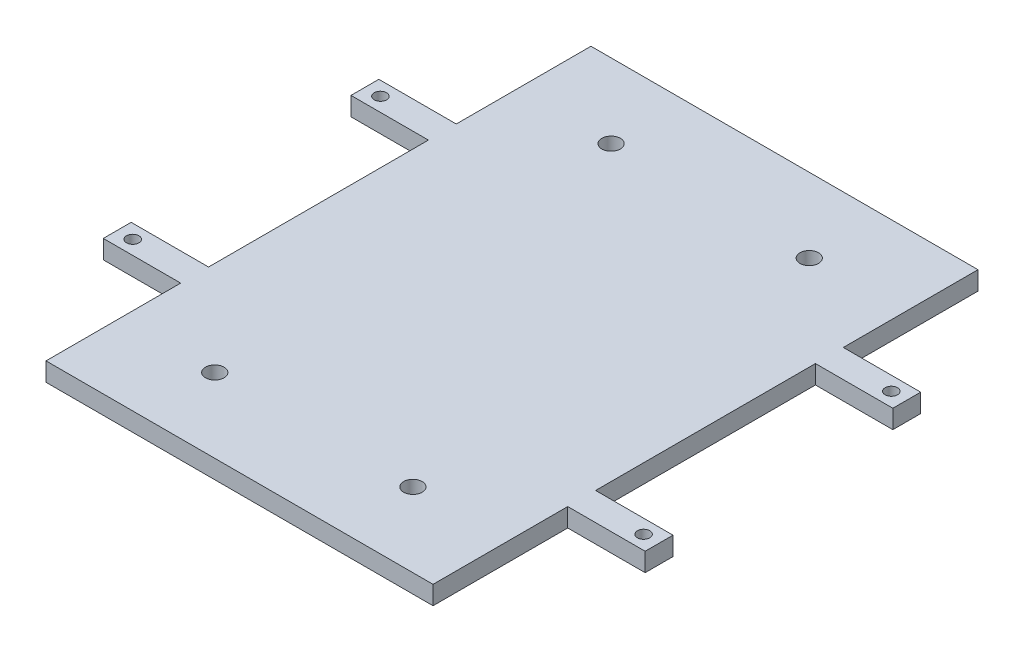
ISO-10303-21;
HEADER;
FILE_DESCRIPTION(('STEP AP214'),'2;1');
FILE_NAME('part.step','',(''),(''),'','','');
FILE_SCHEMA(('AUTOMOTIVE_DESIGN { 1 0 10303 214 1 1 1 1 }'));
ENDSEC;
DATA;
#1=APPLICATION_CONTEXT('core data for automotive mechanical design processes');
#2=APPLICATION_PROTOCOL_DEFINITION('international standard','automotive_design',2000,#1);
#3=PRODUCT_CONTEXT('',#1,'mechanical');
#4=PRODUCT('Part','Part','',(#3));
#5=PRODUCT_RELATED_PRODUCT_CATEGORY('part','',(#4));
#6=PRODUCT_DEFINITION_FORMATION('','',#4);
#7=PRODUCT_DEFINITION_CONTEXT('part definition',#1,'design');
#8=PRODUCT_DEFINITION('design','',#6,#7);
#9=PRODUCT_DEFINITION_SHAPE('','',#8);
#10=(LENGTH_UNIT() NAMED_UNIT(*) SI_UNIT(.MILLI.,.METRE.));
#11=(NAMED_UNIT(*) PLANE_ANGLE_UNIT() SI_UNIT($,.RADIAN.));
#12=(NAMED_UNIT(*) SI_UNIT($,.STERADIAN.) SOLID_ANGLE_UNIT());
#13=UNCERTAINTY_MEASURE_WITH_UNIT(LENGTH_MEASURE(1.E-05),#10,'distance_accuracy_value','');
#14=(GEOMETRIC_REPRESENTATION_CONTEXT(3) GLOBAL_UNCERTAINTY_ASSIGNED_CONTEXT((#13)) GLOBAL_UNIT_ASSIGNED_CONTEXT((#10,
#11,#12)) REPRESENTATION_CONTEXT('',''));
#15=CARTESIAN_POINT('',(0.,0.,0.));
#16=DIRECTION('',(0.,0.,1.));
#17=DIRECTION('',(1.,0.,0.));
#18=AXIS2_PLACEMENT_3D('',#15,#16,#17);
#19=CARTESIAN_POINT('',(31.25,3.,-44.));
#20=DIRECTION('',(-1.,0.,0.));
#21=DIRECTION('',(0.,0.,1.));
#22=AXIS2_PLACEMENT_3D('',#19,#20,#21);
#23=PLANE('',#22);
#24=DIRECTION('',(0.,0.,-1.));
#25=VECTOR('',#24,1.);
#26=CARTESIAN_POINT('',(31.25,0.,-44.));
#27=LINE('',#26,#25);
#28=CARTESIAN_POINT('',(31.25,0.,-22.25));
#29=VERTEX_POINT('',#28);
#30=CARTESIAN_POINT('',(31.25,0.,-44.));
#31=VERTEX_POINT('',#30);
#32=EDGE_CURVE('E205',#29,#31,#27,.T.);
#33=ORIENTED_EDGE('',*,*,#32,.T.);
#34=DIRECTION('',(0.,-1.,0.));
#35=VECTOR('',#34,1.);
#36=CARTESIAN_POINT('',(31.25,3.,-44.));
#37=LINE('',#36,#35);
#38=CARTESIAN_POINT('',(31.25,3.,-44.));
#39=VERTEX_POINT('',#38);
#40=EDGE_CURVE('E11',#39,#31,#37,.T.);
#41=ORIENTED_EDGE('',*,*,#40,.F.);
#42=DIRECTION('',(0.,0.,-1.));
#43=VECTOR('',#42,1.);
#44=CARTESIAN_POINT('',(31.25,3.,-44.));
#45=LINE('',#44,#43);
#46=CARTESIAN_POINT('',(31.25,3.,-22.25));
#47=VERTEX_POINT('',#46);
#48=EDGE_CURVE('E244',#47,#39,#45,.T.);
#49=ORIENTED_EDGE('',*,*,#48,.F.);
#50=DIRECTION('',(0.,-1.,0.));
#51=VECTOR('',#50,1.);
#52=CARTESIAN_POINT('',(31.25,3.,-22.25));
#53=LINE('',#52,#51);
#54=EDGE_CURVE('E201',#47,#29,#53,.T.);
#55=ORIENTED_EDGE('',*,*,#54,.T.);
#56=EDGE_LOOP('',(#33,#41,#49,#55));
#57=FACE_BOUND('',#56,.T.);
#58=ADVANCED_FACE('F35',(#57),#23,.F.);
#59=CARTESIAN_POINT('',(31.25,3.,-44.));
#60=DIRECTION('',(0.,0.,1.));
#61=DIRECTION('',(1.,0.,0.));
#62=AXIS2_PLACEMENT_3D('',#59,#60,#61);
#63=PLANE('',#62);
#64=DIRECTION('',(-1.,0.,0.));
#65=VECTOR('',#64,1.);
#66=CARTESIAN_POINT('',(31.25,0.,-44.));
#67=LINE('',#66,#65);
#68=CARTESIAN_POINT('',(-31.25,0.,-44.));
#69=VERTEX_POINT('',#68);
#70=EDGE_CURVE('E208',#31,#69,#67,.T.);
#71=ORIENTED_EDGE('',*,*,#70,.T.);
#72=DIRECTION('',(0.,-1.,0.));
#73=VECTOR('',#72,1.);
#74=CARTESIAN_POINT('',(-31.25,3.,-44.));
#75=LINE('',#74,#73);
#76=CARTESIAN_POINT('',(-31.25,3.,-44.));
#77=VERTEX_POINT('',#76);
#78=EDGE_CURVE('E44',#77,#69,#75,.T.);
#79=ORIENTED_EDGE('',*,*,#78,.F.);
#80=DIRECTION('',(-1.,0.,0.));
#81=VECTOR('',#80,1.);
#82=CARTESIAN_POINT('',(31.25,3.,-44.));
#83=LINE('',#82,#81);
#84=EDGE_CURVE('E132',#39,#77,#83,.T.);
#85=ORIENTED_EDGE('',*,*,#84,.F.);
#86=ORIENTED_EDGE('',*,*,#40,.T.);
#87=EDGE_LOOP('',(#71,#79,#85,#86));
#88=FACE_BOUND('',#87,.T.);
#89=ADVANCED_FACE('F388',(#88),#63,.F.);
#90=CARTESIAN_POINT('',(-31.25,3.,-44.));
#91=DIRECTION('',(1.,0.,0.));
#92=DIRECTION('',(0.,0.,-1.));
#93=AXIS2_PLACEMENT_3D('',#90,#91,#92);
#94=PLANE('',#93);
#95=DIRECTION('',(0.,0.,1.));
#96=VECTOR('',#95,1.);
#97=CARTESIAN_POINT('',(-31.25,0.,-44.));
#98=LINE('',#97,#96);
#99=CARTESIAN_POINT('',(-31.25,0.,-22.25));
#100=VERTEX_POINT('',#99);
#101=EDGE_CURVE('E211',#69,#100,#98,.T.);
#102=ORIENTED_EDGE('',*,*,#101,.T.);
#103=DIRECTION('',(0.,-1.,0.));
#104=VECTOR('',#103,1.);
#105=CARTESIAN_POINT('',(-31.25,3.,-22.25));
#106=LINE('',#105,#104);
#107=CARTESIAN_POINT('',(-31.25,3.,-22.25));
#108=VERTEX_POINT('',#107);
#109=EDGE_CURVE('E287',#108,#100,#106,.T.);
#110=ORIENTED_EDGE('',*,*,#109,.F.);
#111=DIRECTION('',(0.,0.,1.));
#112=VECTOR('',#111,1.);
#113=CARTESIAN_POINT('',(-31.25,3.,-44.));
#114=LINE('',#113,#112);
#115=EDGE_CURVE('E332',#77,#108,#114,.T.);
#116=ORIENTED_EDGE('',*,*,#115,.F.);
#117=ORIENTED_EDGE('',*,*,#78,.T.);
#118=EDGE_LOOP('',(#102,#110,#116,#117));
#119=FACE_BOUND('',#118,.T.);
#120=ADVANCED_FACE('F392',(#119),#94,.F.);
#121=CARTESIAN_POINT('',(-43.75,3.,-22.25));
#122=DIRECTION('',(0.,0.,1.));
#123=DIRECTION('',(1.,0.,0.));
#124=AXIS2_PLACEMENT_3D('',#121,#122,#123);
#125=PLANE('',#124);
#126=DIRECTION('',(-1.,0.,0.));
#127=VECTOR('',#126,1.);
#128=CARTESIAN_POINT('',(-43.75,0.,-22.25));
#129=LINE('',#128,#127);
#130=CARTESIAN_POINT('',(-43.75,0.,-22.25));
#131=VERTEX_POINT('',#130);
#132=EDGE_CURVE('E213',#100,#131,#129,.T.);
#133=ORIENTED_EDGE('',*,*,#132,.T.);
#134=DIRECTION('',(0.,-1.,0.));
#135=VECTOR('',#134,1.);
#136=CARTESIAN_POINT('',(-43.75,3.,-22.25));
#137=LINE('',#136,#135);
#138=CARTESIAN_POINT('',(-43.75,3.,-22.25));
#139=VERTEX_POINT('',#138);
#140=EDGE_CURVE('E284',#139,#131,#137,.T.);
#141=ORIENTED_EDGE('',*,*,#140,.F.);
#142=DIRECTION('',(-1.,0.,0.));
#143=VECTOR('',#142,1.);
#144=CARTESIAN_POINT('',(-43.75,3.,-22.25));
#145=LINE('',#144,#143);
#146=EDGE_CURVE('E334',#108,#139,#145,.T.);
#147=ORIENTED_EDGE('',*,*,#146,.F.);
#148=ORIENTED_EDGE('',*,*,#109,.T.);
#149=EDGE_LOOP('',(#133,#141,#147,#148));
#150=FACE_BOUND('',#149,.T.);
#151=ADVANCED_FACE('F396',(#150),#125,.F.);
#152=CARTESIAN_POINT('',(-43.75,3.,-22.25));
#153=DIRECTION('',(1.,0.,0.));
#154=DIRECTION('',(0.,0.,-1.));
#155=AXIS2_PLACEMENT_3D('',#152,#153,#154);
#156=PLANE('',#155);
#157=DIRECTION('',(0.,0.,1.));
#158=VECTOR('',#157,1.);
#159=CARTESIAN_POINT('',(-43.75,0.,-22.25));
#160=LINE('',#159,#158);
#161=CARTESIAN_POINT('',(-43.75,0.,-17.75));
#162=VERTEX_POINT('',#161);
#163=EDGE_CURVE('E215',#131,#162,#160,.T.);
#164=ORIENTED_EDGE('',*,*,#163,.T.);
#165=DIRECTION('',(0.,-1.,0.));
#166=VECTOR('',#165,1.);
#167=CARTESIAN_POINT('',(-43.75,3.,-17.75));
#168=LINE('',#167,#166);
#169=CARTESIAN_POINT('',(-43.75,3.,-17.75));
#170=VERTEX_POINT('',#169);
#171=EDGE_CURVE('E281',#170,#162,#168,.T.);
#172=ORIENTED_EDGE('',*,*,#171,.F.);
#173=DIRECTION('',(0.,0.,1.));
#174=VECTOR('',#173,1.);
#175=CARTESIAN_POINT('',(-43.75,3.,-22.25));
#176=LINE('',#175,#174);
#177=EDGE_CURVE('E336',#139,#170,#176,.T.);
#178=ORIENTED_EDGE('',*,*,#177,.F.);
#179=ORIENTED_EDGE('',*,*,#140,.T.);
#180=EDGE_LOOP('',(#164,#172,#178,#179));
#181=FACE_BOUND('',#180,.T.);
#182=ADVANCED_FACE('F402',(#181),#156,.F.);
#183=CARTESIAN_POINT('',(-43.75,3.,-17.75));
#184=DIRECTION('',(0.,0.,-1.));
#185=DIRECTION('',(-1.,0.,0.));
#186=AXIS2_PLACEMENT_3D('',#183,#184,#185);
#187=PLANE('',#186);
#188=DIRECTION('',(1.,0.,0.));
#189=VECTOR('',#188,1.);
#190=CARTESIAN_POINT('',(-43.75,0.,-17.75));
#191=LINE('',#190,#189);
#192=CARTESIAN_POINT('',(-31.25,0.,-17.75));
#193=VERTEX_POINT('',#192);
#194=EDGE_CURVE('E217',#162,#193,#191,.T.);
#195=ORIENTED_EDGE('',*,*,#194,.T.);
#196=DIRECTION('',(0.,-1.,0.));
#197=VECTOR('',#196,1.);
#198=CARTESIAN_POINT('',(-31.25,3.,-17.75));
#199=LINE('',#198,#197);
#200=CARTESIAN_POINT('',(-31.25,3.,-17.75));
#201=VERTEX_POINT('',#200);
#202=EDGE_CURVE('E278',#201,#193,#199,.T.);
#203=ORIENTED_EDGE('',*,*,#202,.F.);
#204=DIRECTION('',(1.,0.,0.));
#205=VECTOR('',#204,1.);
#206=CARTESIAN_POINT('',(-43.75,3.,-17.75));
#207=LINE('',#206,#205);
#208=EDGE_CURVE('E338',#170,#201,#207,.T.);
#209=ORIENTED_EDGE('',*,*,#208,.F.);
#210=ORIENTED_EDGE('',*,*,#171,.T.);
#211=EDGE_LOOP('',(#195,#203,#209,#210));
#212=FACE_BOUND('',#211,.T.);
#213=ADVANCED_FACE('F406',(#212),#187,.F.);
#214=CARTESIAN_POINT('',(-31.25,3.,17.75));
#215=DIRECTION('',(1.,0.,0.));
#216=DIRECTION('',(0.,0.,-1.));
#217=AXIS2_PLACEMENT_3D('',#214,#215,#216);
#218=PLANE('',#217);
#219=DIRECTION('',(0.,0.,1.));
#220=VECTOR('',#219,1.);
#221=CARTESIAN_POINT('',(-31.25,0.,17.75));
#222=LINE('',#221,#220);
#223=CARTESIAN_POINT('',(-31.25,0.,17.75));
#224=VERTEX_POINT('',#223);
#225=EDGE_CURVE('E219',#193,#224,#222,.T.);
#226=ORIENTED_EDGE('',*,*,#225,.T.);
#227=DIRECTION('',(0.,-1.,0.));
#228=VECTOR('',#227,1.);
#229=CARTESIAN_POINT('',(-31.25,3.,17.75));
#230=LINE('',#229,#228);
#231=CARTESIAN_POINT('',(-31.25,3.,17.75));
#232=VERTEX_POINT('',#231);
#233=EDGE_CURVE('E275',#232,#224,#230,.T.);
#234=ORIENTED_EDGE('',*,*,#233,.F.);
#235=DIRECTION('',(0.,0.,1.));
#236=VECTOR('',#235,1.);
#237=CARTESIAN_POINT('',(-31.25,3.,17.75));
#238=LINE('',#237,#236);
#239=EDGE_CURVE('E340',#201,#232,#238,.T.);
#240=ORIENTED_EDGE('',*,*,#239,.F.);
#241=ORIENTED_EDGE('',*,*,#202,.T.);
#242=EDGE_LOOP('',(#226,#234,#240,#241));
#243=FACE_BOUND('',#242,.T.);
#244=ADVANCED_FACE('F410',(#243),#218,.F.);
#245=CARTESIAN_POINT('',(-43.75,3.,17.75));
#246=DIRECTION('',(0.,0.,1.));
#247=DIRECTION('',(1.,0.,0.));
#248=AXIS2_PLACEMENT_3D('',#245,#246,#247);
#249=PLANE('',#248);
#250=DIRECTION('',(-1.,0.,0.));
#251=VECTOR('',#250,1.);
#252=CARTESIAN_POINT('',(-43.75,0.,17.75));
#253=LINE('',#252,#251);
#254=CARTESIAN_POINT('',(-43.75,0.,17.75));
#255=VERTEX_POINT('',#254);
#256=EDGE_CURVE('E221',#224,#255,#253,.T.);
#257=ORIENTED_EDGE('',*,*,#256,.T.);
#258=DIRECTION('',(0.,-1.,0.));
#259=VECTOR('',#258,1.);
#260=CARTESIAN_POINT('',(-43.75,3.,17.75));
#261=LINE('',#260,#259);
#262=CARTESIAN_POINT('',(-43.75,3.,17.75));
#263=VERTEX_POINT('',#262);
#264=EDGE_CURVE('E272',#263,#255,#261,.T.);
#265=ORIENTED_EDGE('',*,*,#264,.F.);
#266=DIRECTION('',(-1.,0.,0.));
#267=VECTOR('',#266,1.);
#268=CARTESIAN_POINT('',(-43.75,3.,17.75));
#269=LINE('',#268,#267);
#270=EDGE_CURVE('E342',#232,#263,#269,.T.);
#271=ORIENTED_EDGE('',*,*,#270,.F.);
#272=ORIENTED_EDGE('',*,*,#233,.T.);
#273=EDGE_LOOP('',(#257,#265,#271,#272));
#274=FACE_BOUND('',#273,.T.);
#275=ADVANCED_FACE('F414',(#274),#249,.F.);
#276=CARTESIAN_POINT('',(-43.75,3.,22.25));
#277=DIRECTION('',(1.,0.,0.));
#278=DIRECTION('',(0.,0.,-1.));
#279=AXIS2_PLACEMENT_3D('',#276,#277,#278);
#280=PLANE('',#279);
#281=DIRECTION('',(0.,0.,1.));
#282=VECTOR('',#281,1.);
#283=CARTESIAN_POINT('',(-43.75,0.,22.25));
#284=LINE('',#283,#282);
#285=CARTESIAN_POINT('',(-43.75,0.,22.25));
#286=VERTEX_POINT('',#285);
#287=EDGE_CURVE('E223',#255,#286,#284,.T.);
#288=ORIENTED_EDGE('',*,*,#287,.T.);
#289=DIRECTION('',(0.,-1.,0.));
#290=VECTOR('',#289,1.);
#291=CARTESIAN_POINT('',(-43.75,3.,22.25));
#292=LINE('',#291,#290);
#293=CARTESIAN_POINT('',(-43.75,3.,22.25));
#294=VERTEX_POINT('',#293);
#295=EDGE_CURVE('E269',#294,#286,#292,.T.);
#296=ORIENTED_EDGE('',*,*,#295,.F.);
#297=DIRECTION('',(0.,0.,1.));
#298=VECTOR('',#297,1.);
#299=CARTESIAN_POINT('',(-43.75,3.,22.25));
#300=LINE('',#299,#298);
#301=EDGE_CURVE('E344',#263,#294,#300,.T.);
#302=ORIENTED_EDGE('',*,*,#301,.F.);
#303=ORIENTED_EDGE('',*,*,#264,.T.);
#304=EDGE_LOOP('',(#288,#296,#302,#303));
#305=FACE_BOUND('',#304,.T.);
#306=ADVANCED_FACE('F418',(#305),#280,.F.);
#307=CARTESIAN_POINT('',(-43.75,3.,22.25));
#308=DIRECTION('',(0.,0.,-1.));
#309=DIRECTION('',(-1.,0.,0.));
#310=AXIS2_PLACEMENT_3D('',#307,#308,#309);
#311=PLANE('',#310);
#312=DIRECTION('',(1.,0.,0.));
#313=VECTOR('',#312,1.);
#314=CARTESIAN_POINT('',(-43.75,0.,22.25));
#315=LINE('',#314,#313);
#316=CARTESIAN_POINT('',(-31.25,0.,22.25));
#317=VERTEX_POINT('',#316);
#318=EDGE_CURVE('E225',#286,#317,#315,.T.);
#319=ORIENTED_EDGE('',*,*,#318,.T.);
#320=DIRECTION('',(0.,-1.,0.));
#321=VECTOR('',#320,1.);
#322=CARTESIAN_POINT('',(-31.25,3.,22.25));
#323=LINE('',#322,#321);
#324=CARTESIAN_POINT('',(-31.25,3.,22.25));
#325=VERTEX_POINT('',#324);
#326=EDGE_CURVE('E266',#325,#317,#323,.T.);
#327=ORIENTED_EDGE('',*,*,#326,.F.);
#328=DIRECTION('',(1.,0.,0.));
#329=VECTOR('',#328,1.);
#330=CARTESIAN_POINT('',(-43.75,3.,22.25));
#331=LINE('',#330,#329);
#332=EDGE_CURVE('E346',#294,#325,#331,.T.);
#333=ORIENTED_EDGE('',*,*,#332,.F.);
#334=ORIENTED_EDGE('',*,*,#295,.T.);
#335=EDGE_LOOP('',(#319,#327,#333,#334));
#336=FACE_BOUND('',#335,.T.);
#337=ADVANCED_FACE('F422',(#336),#311,.F.);
#338=CARTESIAN_POINT('',(-31.25,3.,44.));
#339=DIRECTION('',(1.,0.,0.));
#340=DIRECTION('',(0.,0.,-1.));
#341=AXIS2_PLACEMENT_3D('',#338,#339,#340);
#342=PLANE('',#341);
#343=DIRECTION('',(0.,0.,1.));
#344=VECTOR('',#343,1.);
#345=CARTESIAN_POINT('',(-31.25,0.,44.));
#346=LINE('',#345,#344);
#347=CARTESIAN_POINT('',(-31.25,0.,44.));
#348=VERTEX_POINT('',#347);
#349=EDGE_CURVE('E227',#317,#348,#346,.T.);
#350=ORIENTED_EDGE('',*,*,#349,.T.);
#351=DIRECTION('',(0.,-1.,0.));
#352=VECTOR('',#351,1.);
#353=CARTESIAN_POINT('',(-31.25,3.,44.));
#354=LINE('',#353,#352);
#355=CARTESIAN_POINT('',(-31.25,3.,44.));
#356=VERTEX_POINT('',#355);
#357=EDGE_CURVE('E263',#356,#348,#354,.T.);
#358=ORIENTED_EDGE('',*,*,#357,.F.);
#359=DIRECTION('',(0.,0.,1.));
#360=VECTOR('',#359,1.);
#361=CARTESIAN_POINT('',(-31.25,3.,44.));
#362=LINE('',#361,#360);
#363=EDGE_CURVE('E348',#325,#356,#362,.T.);
#364=ORIENTED_EDGE('',*,*,#363,.F.);
#365=ORIENTED_EDGE('',*,*,#326,.T.);
#366=EDGE_LOOP('',(#350,#358,#364,#365));
#367=FACE_BOUND('',#366,.T.);
#368=ADVANCED_FACE('F426',(#367),#342,.F.);
#369=CARTESIAN_POINT('',(31.25,3.,44.));
#370=DIRECTION('',(0.,0.,-1.));
#371=DIRECTION('',(-1.,0.,0.));
#372=AXIS2_PLACEMENT_3D('',#369,#370,#371);
#373=PLANE('',#372);
#374=DIRECTION('',(1.,0.,0.));
#375=VECTOR('',#374,1.);
#376=CARTESIAN_POINT('',(31.25,0.,44.));
#377=LINE('',#376,#375);
#378=CARTESIAN_POINT('',(31.25,0.,44.));
#379=VERTEX_POINT('',#378);
#380=EDGE_CURVE('E229',#348,#379,#377,.T.);
#381=ORIENTED_EDGE('',*,*,#380,.T.);
#382=DIRECTION('',(0.,-1.,0.));
#383=VECTOR('',#382,1.);
#384=CARTESIAN_POINT('',(31.25,3.,44.));
#385=LINE('',#384,#383);
#386=CARTESIAN_POINT('',(31.25,3.,44.));
#387=VERTEX_POINT('',#386);
#388=EDGE_CURVE('E260',#387,#379,#385,.T.);
#389=ORIENTED_EDGE('',*,*,#388,.F.);
#390=DIRECTION('',(1.,0.,0.));
#391=VECTOR('',#390,1.);
#392=CARTESIAN_POINT('',(31.25,3.,44.));
#393=LINE('',#392,#391);
#394=EDGE_CURVE('E350',#356,#387,#393,.T.);
#395=ORIENTED_EDGE('',*,*,#394,.F.);
#396=ORIENTED_EDGE('',*,*,#357,.T.);
#397=EDGE_LOOP('',(#381,#389,#395,#396));
#398=FACE_BOUND('',#397,.T.);
#399=ADVANCED_FACE('F430',(#398),#373,.F.);
#400=CARTESIAN_POINT('',(31.25,3.,44.));
#401=DIRECTION('',(-1.,0.,0.));
#402=DIRECTION('',(0.,0.,1.));
#403=AXIS2_PLACEMENT_3D('',#400,#401,#402);
#404=PLANE('',#403);
#405=DIRECTION('',(0.,0.,-1.));
#406=VECTOR('',#405,1.);
#407=CARTESIAN_POINT('',(31.25,0.,44.));
#408=LINE('',#407,#406);
#409=CARTESIAN_POINT('',(31.25,0.,22.25));
#410=VERTEX_POINT('',#409);
#411=EDGE_CURVE('E231',#379,#410,#408,.T.);
#412=ORIENTED_EDGE('',*,*,#411,.T.);
#413=DIRECTION('',(0.,-1.,0.));
#414=VECTOR('',#413,1.);
#415=CARTESIAN_POINT('',(31.25,3.,22.25));
#416=LINE('',#415,#414);
#417=CARTESIAN_POINT('',(31.25,3.,22.25));
#418=VERTEX_POINT('',#417);
#419=EDGE_CURVE('E257',#418,#410,#416,.T.);
#420=ORIENTED_EDGE('',*,*,#419,.F.);
#421=DIRECTION('',(0.,0.,-1.));
#422=VECTOR('',#421,1.);
#423=CARTESIAN_POINT('',(31.25,3.,44.));
#424=LINE('',#423,#422);
#425=EDGE_CURVE('E352',#387,#418,#424,.T.);
#426=ORIENTED_EDGE('',*,*,#425,.F.);
#427=ORIENTED_EDGE('',*,*,#388,.T.);
#428=EDGE_LOOP('',(#412,#420,#426,#427));
#429=FACE_BOUND('',#428,.T.);
#430=ADVANCED_FACE('F434',(#429),#404,.F.);
#431=CARTESIAN_POINT('',(43.75,3.,22.25));
#432=DIRECTION('',(0.,0.,-1.));
#433=DIRECTION('',(-1.,0.,0.));
#434=AXIS2_PLACEMENT_3D('',#431,#432,#433);
#435=PLANE('',#434);
#436=DIRECTION('',(1.,0.,0.));
#437=VECTOR('',#436,1.);
#438=CARTESIAN_POINT('',(43.75,0.,22.25));
#439=LINE('',#438,#437);
#440=CARTESIAN_POINT('',(43.75,0.,22.25));
#441=VERTEX_POINT('',#440);
#442=EDGE_CURVE('E233',#410,#441,#439,.T.);
#443=ORIENTED_EDGE('',*,*,#442,.T.);
#444=DIRECTION('',(0.,-1.,0.));
#445=VECTOR('',#444,1.);
#446=CARTESIAN_POINT('',(43.75,3.,22.25));
#447=LINE('',#446,#445);
#448=CARTESIAN_POINT('',(43.75,3.,22.25));
#449=VERTEX_POINT('',#448);
#450=EDGE_CURVE('E254',#449,#441,#447,.T.);
#451=ORIENTED_EDGE('',*,*,#450,.F.);
#452=DIRECTION('',(1.,0.,0.));
#453=VECTOR('',#452,1.);
#454=CARTESIAN_POINT('',(43.75,3.,22.25));
#455=LINE('',#454,#453);
#456=EDGE_CURVE('E354',#418,#449,#455,.T.);
#457=ORIENTED_EDGE('',*,*,#456,.F.);
#458=ORIENTED_EDGE('',*,*,#419,.T.);
#459=EDGE_LOOP('',(#443,#451,#457,#458));
#460=FACE_BOUND('',#459,.T.);
#461=ADVANCED_FACE('F438',(#460),#435,.F.);
#462=CARTESIAN_POINT('',(43.75,3.,22.25));
#463=DIRECTION('',(-1.,0.,0.));
#464=DIRECTION('',(0.,0.,1.));
#465=AXIS2_PLACEMENT_3D('',#462,#463,#464);
#466=PLANE('',#465);
#467=DIRECTION('',(0.,0.,-1.));
#468=VECTOR('',#467,1.);
#469=CARTESIAN_POINT('',(43.75,0.,22.25));
#470=LINE('',#469,#468);
#471=CARTESIAN_POINT('',(43.75,0.,17.75));
#472=VERTEX_POINT('',#471);
#473=EDGE_CURVE('E235',#441,#472,#470,.T.);
#474=ORIENTED_EDGE('',*,*,#473,.T.);
#475=DIRECTION('',(0.,-1.,0.));
#476=VECTOR('',#475,1.);
#477=CARTESIAN_POINT('',(43.75,3.,17.75));
#478=LINE('',#477,#476);
#479=CARTESIAN_POINT('',(43.75,3.,17.75));
#480=VERTEX_POINT('',#479);
#481=EDGE_CURVE('E251',#480,#472,#478,.T.);
#482=ORIENTED_EDGE('',*,*,#481,.F.);
#483=DIRECTION('',(0.,0.,-1.));
#484=VECTOR('',#483,1.);
#485=CARTESIAN_POINT('',(43.75,3.,22.25));
#486=LINE('',#485,#484);
#487=EDGE_CURVE('E356',#449,#480,#486,.T.);
#488=ORIENTED_EDGE('',*,*,#487,.F.);
#489=ORIENTED_EDGE('',*,*,#450,.T.);
#490=EDGE_LOOP('',(#474,#482,#488,#489));
#491=FACE_BOUND('',#490,.T.);
#492=ADVANCED_FACE('F442',(#491),#466,.F.);
#493=CARTESIAN_POINT('',(43.75,3.,17.75));
#494=DIRECTION('',(0.,0.,1.));
#495=DIRECTION('',(1.,0.,0.));
#496=AXIS2_PLACEMENT_3D('',#493,#494,#495);
#497=PLANE('',#496);
#498=DIRECTION('',(-1.,0.,0.));
#499=VECTOR('',#498,1.);
#500=CARTESIAN_POINT('',(43.75,0.,17.75));
#501=LINE('',#500,#499);
#502=CARTESIAN_POINT('',(31.25,0.,17.75));
#503=VERTEX_POINT('',#502);
#504=EDGE_CURVE('E237',#472,#503,#501,.T.);
#505=ORIENTED_EDGE('',*,*,#504,.T.);
#506=DIRECTION('',(0.,-1.,0.));
#507=VECTOR('',#506,1.);
#508=CARTESIAN_POINT('',(31.25,3.,17.75));
#509=LINE('',#508,#507);
#510=CARTESIAN_POINT('',(31.25,3.,17.75));
#511=VERTEX_POINT('',#510);
#512=EDGE_CURVE('E248',#511,#503,#509,.T.);
#513=ORIENTED_EDGE('',*,*,#512,.F.);
#514=DIRECTION('',(-1.,0.,0.));
#515=VECTOR('',#514,1.);
#516=CARTESIAN_POINT('',(43.75,3.,17.75));
#517=LINE('',#516,#515);
#518=EDGE_CURVE('E358',#480,#511,#517,.T.);
#519=ORIENTED_EDGE('',*,*,#518,.F.);
#520=ORIENTED_EDGE('',*,*,#481,.T.);
#521=EDGE_LOOP('',(#505,#513,#519,#520));
#522=FACE_BOUND('',#521,.T.);
#523=ADVANCED_FACE('F364',(#522),#497,.F.);
#524=CARTESIAN_POINT('',(31.25,3.,17.75));
#525=DIRECTION('',(-1.,0.,0.));
#526=DIRECTION('',(0.,0.,1.));
#527=AXIS2_PLACEMENT_3D('',#524,#525,#526);
#528=PLANE('',#527);
#529=DIRECTION('',(0.,0.,-1.));
#530=VECTOR('',#529,1.);
#531=CARTESIAN_POINT('',(31.25,0.,17.75));
#532=LINE('',#531,#530);
#533=CARTESIAN_POINT('',(31.25,0.,-17.75));
#534=VERTEX_POINT('',#533);
#535=EDGE_CURVE('E239',#503,#534,#532,.T.);
#536=ORIENTED_EDGE('',*,*,#535,.T.);
#537=DIRECTION('',(0.,-1.,0.));
#538=VECTOR('',#537,1.);
#539=CARTESIAN_POINT('',(31.25,3.,-17.75));
#540=LINE('',#539,#538);
#541=CARTESIAN_POINT('',(31.25,3.,-17.75));
#542=VERTEX_POINT('',#541);
#543=EDGE_CURVE('E196',#542,#534,#540,.T.);
#544=ORIENTED_EDGE('',*,*,#543,.F.);
#545=DIRECTION('',(0.,0.,-1.));
#546=VECTOR('',#545,1.);
#547=CARTESIAN_POINT('',(31.25,3.,17.75));
#548=LINE('',#547,#546);
#549=EDGE_CURVE('E187',#511,#542,#548,.T.);
#550=ORIENTED_EDGE('',*,*,#549,.F.);
#551=ORIENTED_EDGE('',*,*,#512,.T.);
#552=EDGE_LOOP('',(#536,#544,#550,#551));
#553=FACE_BOUND('',#552,.T.);
#554=ADVANCED_FACE('F368',(#553),#528,.F.);
#555=CARTESIAN_POINT('',(43.75,3.,-17.75));
#556=DIRECTION('',(0.,0.,-1.));
#557=DIRECTION('',(-1.,0.,0.));
#558=AXIS2_PLACEMENT_3D('',#555,#556,#557);
#559=PLANE('',#558);
#560=DIRECTION('',(1.,0.,0.));
#561=VECTOR('',#560,1.);
#562=CARTESIAN_POINT('',(43.75,0.,-17.75));
#563=LINE('',#562,#561);
#564=CARTESIAN_POINT('',(43.75,0.,-17.75));
#565=VERTEX_POINT('',#564);
#566=EDGE_CURVE('E195',#534,#565,#563,.T.);
#567=ORIENTED_EDGE('',*,*,#566,.T.);
#568=DIRECTION('',(0.,-1.,0.));
#569=VECTOR('',#568,1.);
#570=CARTESIAN_POINT('',(43.75,3.,-17.75));
#571=LINE('',#570,#569);
#572=CARTESIAN_POINT('',(43.75,3.,-17.75));
#573=VERTEX_POINT('',#572);
#574=EDGE_CURVE('E192',#573,#565,#571,.T.);
#575=ORIENTED_EDGE('',*,*,#574,.F.);
#576=DIRECTION('',(1.,0.,0.));
#577=VECTOR('',#576,1.);
#578=CARTESIAN_POINT('',(43.75,3.,-17.75));
#579=LINE('',#578,#577);
#580=EDGE_CURVE('E181',#542,#573,#579,.T.);
#581=ORIENTED_EDGE('',*,*,#580,.F.);
#582=ORIENTED_EDGE('',*,*,#543,.T.);
#583=EDGE_LOOP('',(#567,#575,#581,#582));
#584=FACE_BOUND('',#583,.T.);
#585=ADVANCED_FACE('F193',(#584),#559,.F.);
#586=CARTESIAN_POINT('',(43.75,3.,-22.25));
#587=DIRECTION('',(-1.,0.,0.));
#588=DIRECTION('',(0.,0.,1.));
#589=AXIS2_PLACEMENT_3D('',#586,#587,#588);
#590=PLANE('',#589);
#591=DIRECTION('',(0.,0.,-1.));
#592=VECTOR('',#591,1.);
#593=CARTESIAN_POINT('',(43.75,0.,-22.25));
#594=LINE('',#593,#592);
#595=CARTESIAN_POINT('',(43.75,0.,-22.25));
#596=VERTEX_POINT('',#595);
#597=EDGE_CURVE('E118',#565,#596,#594,.T.);
#598=ORIENTED_EDGE('',*,*,#597,.T.);
#599=DIRECTION('',(0.,-1.,0.));
#600=VECTOR('',#599,1.);
#601=CARTESIAN_POINT('',(43.75,3.,-22.25));
#602=LINE('',#601,#600);
#603=CARTESIAN_POINT('',(43.75,3.,-22.25));
#604=VERTEX_POINT('',#603);
#605=EDGE_CURVE('E197',#604,#596,#602,.T.);
#606=ORIENTED_EDGE('',*,*,#605,.F.);
#607=DIRECTION('',(0.,0.,-1.));
#608=VECTOR('',#607,1.);
#609=CARTESIAN_POINT('',(43.75,3.,-22.25));
#610=LINE('',#609,#608);
#611=EDGE_CURVE('E185',#573,#604,#610,.T.);
#612=ORIENTED_EDGE('',*,*,#611,.F.);
#613=ORIENTED_EDGE('',*,*,#574,.T.);
#614=EDGE_LOOP('',(#598,#606,#612,#613));
#615=FACE_BOUND('',#614,.T.);
#616=ADVANCED_FACE('F199',(#615),#590,.F.);
#617=CARTESIAN_POINT('',(43.75,3.,-22.25));
#618=DIRECTION('',(0.,0.,1.));
#619=DIRECTION('',(1.,0.,0.));
#620=AXIS2_PLACEMENT_3D('',#617,#618,#619);
#621=PLANE('',#620);
#622=DIRECTION('',(-1.,0.,0.));
#623=VECTOR('',#622,1.);
#624=CARTESIAN_POINT('',(43.75,0.,-22.25));
#625=LINE('',#624,#623);
#626=EDGE_CURVE('E124',#596,#29,#625,.T.);
#627=ORIENTED_EDGE('',*,*,#626,.T.);
#628=ORIENTED_EDGE('',*,*,#54,.F.);
#629=DIRECTION('',(-1.,0.,0.));
#630=VECTOR('',#629,1.);
#631=CARTESIAN_POINT('',(43.75,3.,-22.25));
#632=LINE('',#631,#630);
#633=EDGE_CURVE('E53',#604,#47,#632,.T.);
#634=ORIENTED_EDGE('',*,*,#633,.F.);
#635=ORIENTED_EDGE('',*,*,#605,.T.);
#636=EDGE_LOOP('',(#627,#628,#634,#635));
#637=FACE_BOUND('',#636,.T.);
#638=ADVANCED_FACE('F376',(#637),#621,.F.);
#639=CARTESIAN_POINT('',(0.,3.,0.));
#640=DIRECTION('',(0.,-1.,0.));
#641=DIRECTION('',(0.,0.,-1.));
#642=AXIS2_PLACEMENT_3D('',#639,#640,#641);
#643=PLANE('',#642);
#644=CARTESIAN_POINT('',(-16.,3.,32.));
#645=DIRECTION('',(0.,1.,0.));
#646=DIRECTION('',(0.,0.,1.));
#647=AXIS2_PLACEMENT_3D('',#644,#645,#646);
#648=CIRCLE('',#647,1.5);
#649=CARTESIAN_POINT('',(-16.,3.,33.5));
#650=VERTEX_POINT('',#649);
#651=EDGE_CURVE('E562',#650,#650,#648,.T.);
#652=ORIENTED_EDGE('',*,*,#651,.F.);
#653=EDGE_LOOP('',(#652));
#654=FACE_BOUND('',#653,.T.);
#655=CARTESIAN_POINT('',(16.,3.,32.));
#656=DIRECTION('',(0.,1.,0.));
#657=DIRECTION('',(0.,0.,1.));
#658=AXIS2_PLACEMENT_3D('',#655,#656,#657);
#659=CIRCLE('',#658,1.5);
#660=CARTESIAN_POINT('',(16.,3.,33.5));
#661=VERTEX_POINT('',#660);
#662=EDGE_CURVE('E563',#661,#661,#659,.T.);
#663=ORIENTED_EDGE('',*,*,#662,.F.);
#664=EDGE_LOOP('',(#663));
#665=FACE_BOUND('',#664,.T.);
#666=CARTESIAN_POINT('',(16.,3.,-32.));
#667=DIRECTION('',(0.,1.,0.));
#668=DIRECTION('',(0.,0.,1.));
#669=AXIS2_PLACEMENT_3D('',#666,#667,#668);
#670=CIRCLE('',#669,1.5);
#671=CARTESIAN_POINT('',(16.,3.,-30.5));
#672=VERTEX_POINT('',#671);
#673=EDGE_CURVE('E566',#672,#672,#670,.T.);
#674=ORIENTED_EDGE('',*,*,#673,.F.);
#675=EDGE_LOOP('',(#674));
#676=FACE_BOUND('',#675,.T.);
#677=CARTESIAN_POINT('',(-16.,3.,-32.));
#678=DIRECTION('',(0.,1.,0.));
#679=DIRECTION('',(0.,0.,1.));
#680=AXIS2_PLACEMENT_3D('',#677,#678,#679);
#681=CIRCLE('',#680,1.5);
#682=CARTESIAN_POINT('',(-16.,3.,-30.5));
#683=VERTEX_POINT('',#682);
#684=EDGE_CURVE('E296',#683,#683,#681,.T.);
#685=ORIENTED_EDGE('',*,*,#684,.F.);
#686=EDGE_LOOP('',(#685));
#687=FACE_BOUND('',#686,.T.);
#688=CARTESIAN_POINT('',(41.25,3.,20.));
#689=DIRECTION('',(0.,-1.,0.));
#690=DIRECTION('',(0.,0.,-1.));
#691=AXIS2_PLACEMENT_3D('',#688,#689,#690);
#692=CIRCLE('',#691,0.999999999999998);
#693=CARTESIAN_POINT('',(41.25,3.,19.));
#694=VERTEX_POINT('',#693);
#695=EDGE_CURVE('E209',#694,#694,#692,.T.);
#696=ORIENTED_EDGE('',*,*,#695,.T.);
#697=EDGE_LOOP('',(#696));
#698=FACE_BOUND('',#697,.T.);
#699=CARTESIAN_POINT('',(41.25,3.,-20.));
#700=DIRECTION('',(0.,-1.,0.));
#701=DIRECTION('',(0.,0.,-1.));
#702=AXIS2_PLACEMENT_3D('',#699,#700,#701);
#703=CIRCLE('',#702,0.999999999999998);
#704=CARTESIAN_POINT('',(41.25,3.,-21.));
#705=VERTEX_POINT('',#704);
#706=EDGE_CURVE('E325',#705,#705,#703,.T.);
#707=ORIENTED_EDGE('',*,*,#706,.T.);
#708=EDGE_LOOP('',(#707));
#709=FACE_BOUND('',#708,.T.);
#710=CARTESIAN_POINT('',(-41.25,3.,-20.));
#711=DIRECTION('',(0.,-1.,0.));
#712=DIRECTION('',(0.,0.,-1.));
#713=AXIS2_PLACEMENT_3D('',#710,#711,#712);
#714=CIRCLE('',#713,0.999999999999998);
#715=CARTESIAN_POINT('',(-41.25,3.,-21.));
#716=VERTEX_POINT('',#715);
#717=EDGE_CURVE('E322',#716,#716,#714,.T.);
#718=ORIENTED_EDGE('',*,*,#717,.T.);
#719=EDGE_LOOP('',(#718));
#720=FACE_BOUND('',#719,.T.);
#721=CARTESIAN_POINT('',(-41.25,3.,20.));
#722=DIRECTION('',(0.,-1.,0.));
#723=DIRECTION('',(0.,0.,-1.));
#724=AXIS2_PLACEMENT_3D('',#721,#722,#723);
#725=CIRCLE('',#724,0.999999999999998);
#726=CARTESIAN_POINT('',(-41.25,3.,19.));
#727=VERTEX_POINT('',#726);
#728=EDGE_CURVE('E319',#727,#727,#725,.T.);
#729=ORIENTED_EDGE('',*,*,#728,.T.);
#730=EDGE_LOOP('',(#729));
#731=FACE_BOUND('',#730,.T.);
#732=ORIENTED_EDGE('',*,*,#48,.T.);
#733=ORIENTED_EDGE('',*,*,#84,.T.);
#734=ORIENTED_EDGE('',*,*,#115,.T.);
#735=ORIENTED_EDGE('',*,*,#146,.T.);
#736=ORIENTED_EDGE('',*,*,#177,.T.);
#737=ORIENTED_EDGE('',*,*,#208,.T.);
#738=ORIENTED_EDGE('',*,*,#239,.T.);
#739=ORIENTED_EDGE('',*,*,#270,.T.);
#740=ORIENTED_EDGE('',*,*,#301,.T.);
#741=ORIENTED_EDGE('',*,*,#332,.T.);
#742=ORIENTED_EDGE('',*,*,#363,.T.);
#743=ORIENTED_EDGE('',*,*,#394,.T.);
#744=ORIENTED_EDGE('',*,*,#425,.T.);
#745=ORIENTED_EDGE('',*,*,#456,.T.);
#746=ORIENTED_EDGE('',*,*,#487,.T.);
#747=ORIENTED_EDGE('',*,*,#518,.T.);
#748=ORIENTED_EDGE('',*,*,#549,.T.);
#749=ORIENTED_EDGE('',*,*,#580,.T.);
#750=ORIENTED_EDGE('',*,*,#611,.T.);
#751=ORIENTED_EDGE('',*,*,#633,.T.);
#752=EDGE_LOOP('',(#732,#733,#734,#735,#736,#737,#738,#739,#740,#741,#742,#743,#744,#745,#746,
#747,#748,#749,#750,#751));
#753=FACE_BOUND('',#752,.T.);
#754=ADVANCED_FACE('F183',(#654,#665,#676,#687,#698,#709,#720,#731,#753),#643,.F.);
#755=CARTESIAN_POINT('',(0.,0.,0.));
#756=DIRECTION('',(0.,-1.,0.));
#757=DIRECTION('',(0.,0.,-1.));
#758=AXIS2_PLACEMENT_3D('',#755,#756,#757);
#759=PLANE('',#758);
#760=CARTESIAN_POINT('',(-16.,0.,32.));
#761=DIRECTION('',(0.,-1.,0.));
#762=DIRECTION('',(0.,0.,-1.));
#763=AXIS2_PLACEMENT_3D('',#760,#761,#762);
#764=CIRCLE('',#763,1.5);
#765=CARTESIAN_POINT('',(-16.,0.,30.5));
#766=VERTEX_POINT('',#765);
#767=EDGE_CURVE('E38',#766,#766,#764,.T.);
#768=ORIENTED_EDGE('',*,*,#767,.F.);
#769=EDGE_LOOP('',(#768));
#770=FACE_BOUND('',#769,.T.);
#771=CARTESIAN_POINT('',(16.,0.,32.));
#772=DIRECTION('',(0.,-1.,0.));
#773=DIRECTION('',(0.,0.,-1.));
#774=AXIS2_PLACEMENT_3D('',#771,#772,#773);
#775=CIRCLE('',#774,1.5);
#776=CARTESIAN_POINT('',(16.,0.,30.5));
#777=VERTEX_POINT('',#776);
#778=EDGE_CURVE('E298',#777,#777,#775,.T.);
#779=ORIENTED_EDGE('',*,*,#778,.F.);
#780=EDGE_LOOP('',(#779));
#781=FACE_BOUND('',#780,.T.);
#782=CARTESIAN_POINT('',(16.,0.,-32.));
#783=DIRECTION('',(0.,-1.,0.));
#784=DIRECTION('',(0.,0.,-1.));
#785=AXIS2_PLACEMENT_3D('',#782,#783,#784);
#786=CIRCLE('',#785,1.5);
#787=CARTESIAN_POINT('',(16.,0.,-33.5));
#788=VERTEX_POINT('',#787);
#789=EDGE_CURVE('E295',#788,#788,#786,.T.);
#790=ORIENTED_EDGE('',*,*,#789,.F.);
#791=EDGE_LOOP('',(#790));
#792=FACE_BOUND('',#791,.T.);
#793=CARTESIAN_POINT('',(-16.,0.,-32.));
#794=DIRECTION('',(0.,-1.,0.));
#795=DIRECTION('',(0.,0.,-1.));
#796=AXIS2_PLACEMENT_3D('',#793,#794,#795);
#797=CIRCLE('',#796,1.5);
#798=CARTESIAN_POINT('',(-16.,0.,-33.5));
#799=VERTEX_POINT('',#798);
#800=EDGE_CURVE('E292',#799,#799,#797,.T.);
#801=ORIENTED_EDGE('',*,*,#800,.F.);
#802=EDGE_LOOP('',(#801));
#803=FACE_BOUND('',#802,.T.);
#804=CARTESIAN_POINT('',(41.25,0.,20.));
#805=DIRECTION('',(0.,-1.,0.));
#806=DIRECTION('',(0.,0.,1.));
#807=AXIS2_PLACEMENT_3D('',#804,#805,#806);
#808=CIRCLE('',#807,0.999999999999998);
#809=CARTESIAN_POINT('',(41.25,0.,21.));
#810=VERTEX_POINT('',#809);
#811=EDGE_CURVE('E303',#810,#810,#808,.T.);
#812=ORIENTED_EDGE('',*,*,#811,.F.);
#813=EDGE_LOOP('',(#812));
#814=FACE_BOUND('',#813,.T.);
#815=CARTESIAN_POINT('',(41.25,0.,-20.));
#816=DIRECTION('',(0.,-1.,0.));
#817=DIRECTION('',(0.,0.,-1.));
#818=AXIS2_PLACEMENT_3D('',#815,#816,#817);
#819=CIRCLE('',#818,0.999999999999998);
#820=CARTESIAN_POINT('',(41.25,0.,-21.));
#821=VERTEX_POINT('',#820);
#822=EDGE_CURVE('E307',#821,#821,#819,.T.);
#823=ORIENTED_EDGE('',*,*,#822,.F.);
#824=EDGE_LOOP('',(#823));
#825=FACE_BOUND('',#824,.T.);
#826=CARTESIAN_POINT('',(-41.25,0.,-20.));
#827=DIRECTION('',(0.,-1.,0.));
#828=DIRECTION('',(0.,0.,1.));
#829=AXIS2_PLACEMENT_3D('',#826,#827,#828);
#830=CIRCLE('',#829,0.999999999999998);
#831=CARTESIAN_POINT('',(-41.25,0.,-19.));
#832=VERTEX_POINT('',#831);
#833=EDGE_CURVE('E312',#832,#832,#830,.T.);
#834=ORIENTED_EDGE('',*,*,#833,.F.);
#835=EDGE_LOOP('',(#834));
#836=FACE_BOUND('',#835,.T.);
#837=CARTESIAN_POINT('',(-41.25,0.,20.));
#838=DIRECTION('',(0.,-1.,0.));
#839=DIRECTION('',(0.,0.,-1.));
#840=AXIS2_PLACEMENT_3D('',#837,#838,#839);
#841=CIRCLE('',#840,0.999999999999998);
#842=CARTESIAN_POINT('',(-41.25,0.,19.));
#843=VERTEX_POINT('',#842);
#844=EDGE_CURVE('E316',#843,#843,#841,.T.);
#845=ORIENTED_EDGE('',*,*,#844,.F.);
#846=EDGE_LOOP('',(#845));
#847=FACE_BOUND('',#846,.T.);
#848=ORIENTED_EDGE('',*,*,#32,.F.);
#849=ORIENTED_EDGE('',*,*,#626,.F.);
#850=ORIENTED_EDGE('',*,*,#597,.F.);
#851=ORIENTED_EDGE('',*,*,#566,.F.);
#852=ORIENTED_EDGE('',*,*,#535,.F.);
#853=ORIENTED_EDGE('',*,*,#504,.F.);
#854=ORIENTED_EDGE('',*,*,#473,.F.);
#855=ORIENTED_EDGE('',*,*,#442,.F.);
#856=ORIENTED_EDGE('',*,*,#411,.F.);
#857=ORIENTED_EDGE('',*,*,#380,.F.);
#858=ORIENTED_EDGE('',*,*,#349,.F.);
#859=ORIENTED_EDGE('',*,*,#318,.F.);
#860=ORIENTED_EDGE('',*,*,#287,.F.);
#861=ORIENTED_EDGE('',*,*,#256,.F.);
#862=ORIENTED_EDGE('',*,*,#225,.F.);
#863=ORIENTED_EDGE('',*,*,#194,.F.);
#864=ORIENTED_EDGE('',*,*,#163,.F.);
#865=ORIENTED_EDGE('',*,*,#132,.F.);
#866=ORIENTED_EDGE('',*,*,#101,.F.);
#867=ORIENTED_EDGE('',*,*,#70,.F.);
#868=EDGE_LOOP('',(#848,#849,#850,#851,#852,#853,#854,#855,#856,#857,#858,#859,#860,#861,#862,
#863,#864,#865,#866,#867));
#869=FACE_BOUND('',#868,.T.);
#870=ADVANCED_FACE('F371',(#770,#781,#792,#803,#814,#825,#836,#847,#869),#759,.T.);
#871=CARTESIAN_POINT('',(-41.25,6.,20.));
#872=DIRECTION('',(0.,-1.,0.));
#873=DIRECTION('',(0.,0.,-1.));
#874=AXIS2_PLACEMENT_3D('',#871,#872,#873);
#875=CYLINDRICAL_SURFACE('',#874,0.999999999999998);
#876=ORIENTED_EDGE('',*,*,#844,.T.);
#877=EDGE_LOOP('',(#876));
#878=FACE_BOUND('',#877,.T.);
#879=ORIENTED_EDGE('',*,*,#728,.F.);
#880=EDGE_LOOP('',(#879));
#881=FACE_BOUND('',#880,.T.);
#882=ADVANCED_FACE('F470',(#878,#881),#875,.F.);
#883=CARTESIAN_POINT('',(-41.25,6.,-20.));
#884=DIRECTION('',(0.,-1.,0.));
#885=DIRECTION('',(0.,0.,-1.));
#886=AXIS2_PLACEMENT_3D('',#883,#884,#885);
#887=CYLINDRICAL_SURFACE('',#886,0.999999999999998);
#888=ORIENTED_EDGE('',*,*,#833,.T.);
#889=EDGE_LOOP('',(#888));
#890=FACE_BOUND('',#889,.T.);
#891=ORIENTED_EDGE('',*,*,#717,.F.);
#892=EDGE_LOOP('',(#891));
#893=FACE_BOUND('',#892,.T.);
#894=ADVANCED_FACE('F475',(#890,#893),#887,.F.);
#895=CARTESIAN_POINT('',(41.25,6.,-20.));
#896=DIRECTION('',(0.,-1.,0.));
#897=DIRECTION('',(0.,0.,-1.));
#898=AXIS2_PLACEMENT_3D('',#895,#896,#897);
#899=CYLINDRICAL_SURFACE('',#898,0.999999999999998);
#900=ORIENTED_EDGE('',*,*,#822,.T.);
#901=EDGE_LOOP('',(#900));
#902=FACE_BOUND('',#901,.T.);
#903=ORIENTED_EDGE('',*,*,#706,.F.);
#904=EDGE_LOOP('',(#903));
#905=FACE_BOUND('',#904,.T.);
#906=ADVANCED_FACE('F487',(#902,#905),#899,.F.);
#907=CARTESIAN_POINT('',(41.25,6.,20.));
#908=DIRECTION('',(0.,-1.,0.));
#909=DIRECTION('',(0.,0.,-1.));
#910=AXIS2_PLACEMENT_3D('',#907,#908,#909);
#911=CYLINDRICAL_SURFACE('',#910,0.999999999999998);
#912=ORIENTED_EDGE('',*,*,#811,.T.);
#913=EDGE_LOOP('',(#912));
#914=FACE_BOUND('',#913,.T.);
#915=ORIENTED_EDGE('',*,*,#695,.F.);
#916=EDGE_LOOP('',(#915));
#917=FACE_BOUND('',#916,.T.);
#918=ADVANCED_FACE('F497',(#914,#917),#911,.F.);
#919=CARTESIAN_POINT('',(-16.,-7.,-32.));
#920=DIRECTION('',(0.,1.,0.));
#921=DIRECTION('',(0.,0.,1.));
#922=AXIS2_PLACEMENT_3D('',#919,#920,#921);
#923=CYLINDRICAL_SURFACE('',#922,1.5);
#924=ORIENTED_EDGE('',*,*,#800,.T.);
#925=EDGE_LOOP('',(#924));
#926=FACE_BOUND('',#925,.T.);
#927=ORIENTED_EDGE('',*,*,#684,.T.);
#928=EDGE_LOOP('',(#927));
#929=FACE_BOUND('',#928,.T.);
#930=ADVANCED_FACE('F507',(#926,#929),#923,.F.);
#931=CARTESIAN_POINT('',(16.,-7.,-32.));
#932=DIRECTION('',(0.,1.,0.));
#933=DIRECTION('',(0.,0.,1.));
#934=AXIS2_PLACEMENT_3D('',#931,#932,#933);
#935=CYLINDRICAL_SURFACE('',#934,1.5);
#936=ORIENTED_EDGE('',*,*,#789,.T.);
#937=EDGE_LOOP('',(#936));
#938=FACE_BOUND('',#937,.T.);
#939=ORIENTED_EDGE('',*,*,#673,.T.);
#940=EDGE_LOOP('',(#939));
#941=FACE_BOUND('',#940,.T.);
#942=ADVANCED_FACE('F527',(#938,#941),#935,.F.);
#943=CARTESIAN_POINT('',(16.,-7.,32.));
#944=DIRECTION('',(0.,1.,0.));
#945=DIRECTION('',(0.,0.,1.));
#946=AXIS2_PLACEMENT_3D('',#943,#944,#945);
#947=CYLINDRICAL_SURFACE('',#946,1.5);
#948=ORIENTED_EDGE('',*,*,#778,.T.);
#949=EDGE_LOOP('',(#948));
#950=FACE_BOUND('',#949,.T.);
#951=ORIENTED_EDGE('',*,*,#662,.T.);
#952=EDGE_LOOP('',(#951));
#953=FACE_BOUND('',#952,.T.);
#954=ADVANCED_FACE('F537',(#950,#953),#947,.F.);
#955=CARTESIAN_POINT('',(-16.,-7.,32.));
#956=DIRECTION('',(0.,1.,0.));
#957=DIRECTION('',(0.,0.,1.));
#958=AXIS2_PLACEMENT_3D('',#955,#956,#957);
#959=CYLINDRICAL_SURFACE('',#958,1.5);
#960=ORIENTED_EDGE('',*,*,#767,.T.);
#961=EDGE_LOOP('',(#960));
#962=FACE_BOUND('',#961,.T.);
#963=ORIENTED_EDGE('',*,*,#651,.T.);
#964=EDGE_LOOP('',(#963));
#965=FACE_BOUND('',#964,.T.);
#966=ADVANCED_FACE('F547',(#962,#965),#959,.F.);
#967=CLOSED_SHELL('',(#58,#89,#120,#151,#182,#213,#244,#275,#306,#337,#368,#399,#430,#461,#492,
#523,#554,#585,#616,#638,#754,#870,#882,#894,#906,#918,#930,#942,#954,#966));
#968=MANIFOLD_SOLID_BREP('B2',#967);
#969=ADVANCED_BREP_SHAPE_REPRESENTATION('',(#18,#968),#14);
#970=SHAPE_DEFINITION_REPRESENTATION(#9,#969);
ENDSEC;
END-ISO-10303-21;
